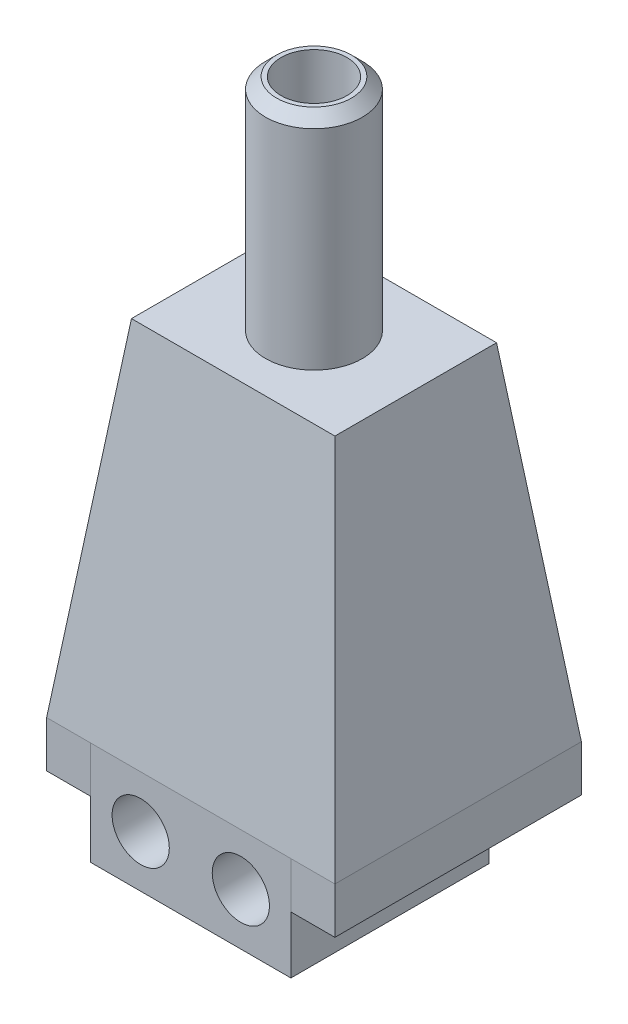
ISO-10303-21;
HEADER;
FILE_DESCRIPTION(('STEP AP214'),'2;1');
FILE_NAME('part.step','',(''),(''),'','','');
FILE_SCHEMA(('AUTOMOTIVE_DESIGN { 1 0 10303 214 1 1 1 1 }'));
ENDSEC;
DATA;
#1=APPLICATION_CONTEXT('core data for automotive mechanical design processes');
#2=APPLICATION_PROTOCOL_DEFINITION('international standard','automotive_design',2000,#1);
#3=PRODUCT_CONTEXT('',#1,'mechanical');
#4=PRODUCT('Part','Part','',(#3));
#5=PRODUCT_RELATED_PRODUCT_CATEGORY('part','',(#4));
#6=PRODUCT_DEFINITION_FORMATION('','',#4);
#7=PRODUCT_DEFINITION_CONTEXT('part definition',#1,'design');
#8=PRODUCT_DEFINITION('design','',#6,#7);
#9=PRODUCT_DEFINITION_SHAPE('','',#8);
#10=(LENGTH_UNIT() NAMED_UNIT(*) SI_UNIT(.MILLI.,.METRE.));
#11=(NAMED_UNIT(*) PLANE_ANGLE_UNIT() SI_UNIT($,.RADIAN.));
#12=(NAMED_UNIT(*) SI_UNIT($,.STERADIAN.) SOLID_ANGLE_UNIT());
#13=UNCERTAINTY_MEASURE_WITH_UNIT(LENGTH_MEASURE(1.E-05),#10,'distance_accuracy_value','');
#14=(GEOMETRIC_REPRESENTATION_CONTEXT(3) GLOBAL_UNCERTAINTY_ASSIGNED_CONTEXT((#13)) GLOBAL_UNIT_ASSIGNED_CONTEXT((#10,
#11,#12)) REPRESENTATION_CONTEXT('',''));
#15=CARTESIAN_POINT('',(0.,0.,0.));
#16=DIRECTION('',(0.,0.,1.));
#17=DIRECTION('',(1.,0.,0.));
#18=AXIS2_PLACEMENT_3D('',#15,#16,#17);
#19=CARTESIAN_POINT('',(0.,2.6,-4.5));
#20=DIRECTION('',(0.,0.,1.));
#21=DIRECTION('',(1.,0.,0.));
#22=AXIS2_PLACEMENT_3D('',#19,#20,#21);
#23=PLANE('',#22);
#24=DIRECTION('',(1.,0.,0.));
#25=VECTOR('',#24,1.);
#26=CARTESIAN_POINT('',(0.,4.7,-4.5));
#27=LINE('',#26,#25);
#28=CARTESIAN_POINT('',(-4.55,4.7,-4.5));
#29=VERTEX_POINT('',#28);
#30=CARTESIAN_POINT('',(4.55,4.7,-4.5));
#31=VERTEX_POINT('',#30);
#32=EDGE_CURVE('E186',#29,#31,#27,.T.);
#33=ORIENTED_EDGE('',*,*,#32,.F.);
#34=DIRECTION('',(0.,1.,0.));
#35=VECTOR('',#34,1.);
#36=CARTESIAN_POINT('',(-4.55,2.6,-4.5));
#37=LINE('',#36,#35);
#38=CARTESIAN_POINT('',(-4.55,2.6,-4.5));
#39=VERTEX_POINT('',#38);
#40=EDGE_CURVE('E12',#39,#29,#37,.T.);
#41=ORIENTED_EDGE('',*,*,#40,.F.);
#42=DIRECTION('',(1.,0.,0.));
#43=VECTOR('',#42,1.);
#44=CARTESIAN_POINT('',(0.,2.6,-4.5));
#45=LINE('',#44,#43);
#46=CARTESIAN_POINT('',(4.55,2.6,-4.5));
#47=VERTEX_POINT('',#46);
#48=EDGE_CURVE('E154',#39,#47,#45,.T.);
#49=ORIENTED_EDGE('',*,*,#48,.T.);
#50=DIRECTION('',(0.,1.,0.));
#51=VECTOR('',#50,1.);
#52=CARTESIAN_POINT('',(4.55,2.6,-4.5));
#53=LINE('',#52,#51);
#54=EDGE_CURVE('E70',#47,#31,#53,.T.);
#55=ORIENTED_EDGE('',*,*,#54,.T.);
#56=EDGE_LOOP('',(#33,#41,#49,#55));
#57=FACE_BOUND('',#56,.T.);
#58=ADVANCED_FACE('F54',(#57),#23,.T.);
#59=CARTESIAN_POINT('',(-4.55,2.6,0.));
#60=DIRECTION('',(1.,0.,0.));
#61=DIRECTION('',(0.,0.,-1.));
#62=AXIS2_PLACEMENT_3D('',#59,#60,#61);
#63=PLANE('',#62);
#64=DIRECTION('',(0.,0.,-1.));
#65=VECTOR('',#64,1.);
#66=CARTESIAN_POINT('',(-4.55,4.7,0.));
#67=LINE('',#66,#65);
#68=CARTESIAN_POINT('',(-4.55,4.7,4.5));
#69=VERTEX_POINT('',#68);
#70=EDGE_CURVE('E182',#69,#29,#67,.T.);
#71=ORIENTED_EDGE('',*,*,#70,.F.);
#72=DIRECTION('',(0.,1.,0.));
#73=VECTOR('',#72,1.);
#74=CARTESIAN_POINT('',(-4.55,2.6,4.5));
#75=LINE('',#74,#73);
#76=CARTESIAN_POINT('',(-4.55,2.6,4.5));
#77=VERTEX_POINT('',#76);
#78=EDGE_CURVE('E62',#77,#69,#75,.T.);
#79=ORIENTED_EDGE('',*,*,#78,.F.);
#80=DIRECTION('',(0.,0.,-1.));
#81=VECTOR('',#80,1.);
#82=CARTESIAN_POINT('',(-4.55,2.6,0.));
#83=LINE('',#82,#81);
#84=EDGE_CURVE('E149',#77,#39,#83,.T.);
#85=ORIENTED_EDGE('',*,*,#84,.T.);
#86=ORIENTED_EDGE('',*,*,#40,.T.);
#87=EDGE_LOOP('',(#71,#79,#85,#86));
#88=FACE_BOUND('',#87,.T.);
#89=ADVANCED_FACE('F185',(#88),#63,.T.);
#90=CARTESIAN_POINT('',(0.,2.6,4.5));
#91=DIRECTION('',(0.,0.,-1.));
#92=DIRECTION('',(-1.,0.,0.));
#93=AXIS2_PLACEMENT_3D('',#90,#91,#92);
#94=PLANE('',#93);
#95=DIRECTION('',(-1.,0.,0.));
#96=VECTOR('',#95,1.);
#97=CARTESIAN_POINT('',(0.,4.7,4.5));
#98=LINE('',#97,#96);
#99=CARTESIAN_POINT('',(-6.55,4.7,4.5));
#100=VERTEX_POINT('',#99);
#101=EDGE_CURVE('E163',#69,#100,#98,.T.);
#102=ORIENTED_EDGE('',*,*,#101,.T.);
#103=DIRECTION('',(0.,1.,0.));
#104=VECTOR('',#103,1.);
#105=CARTESIAN_POINT('',(-6.55,2.6,4.5));
#106=LINE('',#105,#104);
#107=CARTESIAN_POINT('',(-6.55,2.6,4.5));
#108=VERTEX_POINT('',#107);
#109=EDGE_CURVE('E173',#108,#100,#106,.T.);
#110=ORIENTED_EDGE('',*,*,#109,.F.);
#111=DIRECTION('',(-1.,0.,0.));
#112=VECTOR('',#111,1.);
#113=CARTESIAN_POINT('',(0.,2.6,4.5));
#114=LINE('',#113,#112);
#115=EDGE_CURVE('E144',#77,#108,#114,.T.);
#116=ORIENTED_EDGE('',*,*,#115,.F.);
#117=ORIENTED_EDGE('',*,*,#78,.T.);
#118=EDGE_LOOP('',(#102,#110,#116,#117));
#119=FACE_BOUND('',#118,.T.);
#120=ADVANCED_FACE('F177',(#119),#94,.F.);
#121=CARTESIAN_POINT('',(-6.55,2.6,0.));
#122=DIRECTION('',(1.,0.,0.));
#123=DIRECTION('',(0.,0.,-1.));
#124=AXIS2_PLACEMENT_3D('',#121,#122,#123);
#125=PLANE('',#124);
#126=DIRECTION('',(0.,0.,-1.));
#127=VECTOR('',#126,1.);
#128=CARTESIAN_POINT('',(-6.55,4.7,0.));
#129=LINE('',#128,#127);
#130=CARTESIAN_POINT('',(-6.55,4.7,-6.7));
#131=VERTEX_POINT('',#130);
#132=EDGE_CURVE('E184',#100,#131,#129,.T.);
#133=ORIENTED_EDGE('',*,*,#132,.T.);
#134=DIRECTION('',(0.,1.,0.));
#135=VECTOR('',#134,1.);
#136=CARTESIAN_POINT('',(-6.55,2.6,-6.7));
#137=LINE('',#136,#135);
#138=CARTESIAN_POINT('',(-6.55,2.6,-6.7));
#139=VERTEX_POINT('',#138);
#140=EDGE_CURVE('E170',#139,#131,#137,.T.);
#141=ORIENTED_EDGE('',*,*,#140,.F.);
#142=DIRECTION('',(0.,0.,-1.));
#143=VECTOR('',#142,1.);
#144=CARTESIAN_POINT('',(-6.55,2.6,0.));
#145=LINE('',#144,#143);
#146=EDGE_CURVE('E148',#108,#139,#145,.T.);
#147=ORIENTED_EDGE('',*,*,#146,.F.);
#148=ORIENTED_EDGE('',*,*,#109,.T.);
#149=EDGE_LOOP('',(#133,#141,#147,#148));
#150=FACE_BOUND('',#149,.T.);
#151=ADVANCED_FACE('F196',(#150),#125,.F.);
#152=CARTESIAN_POINT('',(0.,2.6,-6.7));
#153=DIRECTION('',(0.,0.,1.));
#154=DIRECTION('',(1.,0.,0.));
#155=AXIS2_PLACEMENT_3D('',#152,#153,#154);
#156=PLANE('',#155);
#157=DIRECTION('',(1.,0.,0.));
#158=VECTOR('',#157,1.);
#159=CARTESIAN_POINT('',(0.,4.7,-6.7));
#160=LINE('',#159,#158);
#161=CARTESIAN_POINT('',(6.55,4.7,-6.7));
#162=VERTEX_POINT('',#161);
#163=EDGE_CURVE('E190',#131,#162,#160,.T.);
#164=ORIENTED_EDGE('',*,*,#163,.T.);
#165=DIRECTION('',(0.,1.,0.));
#166=VECTOR('',#165,1.);
#167=CARTESIAN_POINT('',(6.55,2.6,-6.7));
#168=LINE('',#167,#166);
#169=CARTESIAN_POINT('',(6.55,2.6,-6.7));
#170=VERTEX_POINT('',#169);
#171=EDGE_CURVE('E139',#170,#162,#168,.T.);
#172=ORIENTED_EDGE('',*,*,#171,.F.);
#173=DIRECTION('',(1.,0.,0.));
#174=VECTOR('',#173,1.);
#175=CARTESIAN_POINT('',(0.,2.6,-6.7));
#176=LINE('',#175,#174);
#177=EDGE_CURVE('E127',#139,#170,#176,.T.);
#178=ORIENTED_EDGE('',*,*,#177,.F.);
#179=ORIENTED_EDGE('',*,*,#140,.T.);
#180=EDGE_LOOP('',(#164,#172,#178,#179));
#181=FACE_BOUND('',#180,.T.);
#182=ADVANCED_FACE('F192',(#181),#156,.F.);
#183=CARTESIAN_POINT('',(6.55,2.6,0.));
#184=DIRECTION('',(-1.,0.,0.));
#185=DIRECTION('',(0.,0.,1.));
#186=AXIS2_PLACEMENT_3D('',#183,#184,#185);
#187=PLANE('',#186);
#188=DIRECTION('',(0.,0.,1.));
#189=VECTOR('',#188,1.);
#190=CARTESIAN_POINT('',(6.55,4.7,0.));
#191=LINE('',#190,#189);
#192=CARTESIAN_POINT('',(6.55,4.7,4.5));
#193=VERTEX_POINT('',#192);
#194=EDGE_CURVE('E136',#162,#193,#191,.T.);
#195=ORIENTED_EDGE('',*,*,#194,.T.);
#196=DIRECTION('',(0.,1.,0.));
#197=VECTOR('',#196,1.);
#198=CARTESIAN_POINT('',(6.55,2.6,4.5));
#199=LINE('',#198,#197);
#200=CARTESIAN_POINT('',(6.55,2.6,4.5));
#201=VERTEX_POINT('',#200);
#202=EDGE_CURVE('E133',#201,#193,#199,.T.);
#203=ORIENTED_EDGE('',*,*,#202,.F.);
#204=DIRECTION('',(0.,0.,1.));
#205=VECTOR('',#204,1.);
#206=CARTESIAN_POINT('',(6.55,2.6,0.));
#207=LINE('',#206,#205);
#208=EDGE_CURVE('E120',#170,#201,#207,.T.);
#209=ORIENTED_EDGE('',*,*,#208,.F.);
#210=ORIENTED_EDGE('',*,*,#171,.T.);
#211=EDGE_LOOP('',(#195,#203,#209,#210));
#212=FACE_BOUND('',#211,.T.);
#213=ADVANCED_FACE('F134',(#212),#187,.F.);
#214=CARTESIAN_POINT('',(4.55,4.7,4.5));
#215=VERTEX_POINT('',#214);
#216=EDGE_CURVE('E159',#193,#215,#98,.T.);
#217=ORIENTED_EDGE('',*,*,#216,.T.);
#218=DIRECTION('',(0.,1.,0.));
#219=VECTOR('',#218,1.);
#220=CARTESIAN_POINT('',(4.55,2.6,4.5));
#221=LINE('',#220,#219);
#222=CARTESIAN_POINT('',(4.55,2.6,4.5));
#223=VERTEX_POINT('',#222);
#224=EDGE_CURVE('E96',#223,#215,#221,.T.);
#225=ORIENTED_EDGE('',*,*,#224,.F.);
#226=EDGE_CURVE('E125',#201,#223,#114,.T.);
#227=ORIENTED_EDGE('',*,*,#226,.F.);
#228=ORIENTED_EDGE('',*,*,#202,.T.);
#229=EDGE_LOOP('',(#217,#225,#227,#228));
#230=FACE_BOUND('',#229,.T.);
#231=ADVANCED_FACE('F141',(#230),#94,.F.);
#232=CARTESIAN_POINT('',(4.55,2.6,0.));
#233=DIRECTION('',(-1.,0.,0.));
#234=DIRECTION('',(0.,0.,1.));
#235=AXIS2_PLACEMENT_3D('',#232,#233,#234);
#236=PLANE('',#235);
#237=DIRECTION('',(0.,0.,1.));
#238=VECTOR('',#237,1.);
#239=CARTESIAN_POINT('',(4.55,4.7,0.));
#240=LINE('',#239,#238);
#241=EDGE_CURVE('E156',#31,#215,#240,.T.);
#242=ORIENTED_EDGE('',*,*,#241,.F.);
#243=ORIENTED_EDGE('',*,*,#54,.F.);
#244=DIRECTION('',(0.,0.,1.));
#245=VECTOR('',#244,1.);
#246=CARTESIAN_POINT('',(4.55,2.6,0.));
#247=LINE('',#246,#245);
#248=EDGE_CURVE('E142',#47,#223,#247,.T.);
#249=ORIENTED_EDGE('',*,*,#248,.T.);
#250=ORIENTED_EDGE('',*,*,#224,.T.);
#251=EDGE_LOOP('',(#242,#243,#249,#250));
#252=FACE_BOUND('',#251,.T.);
#253=ADVANCED_FACE('F209',(#252),#236,.T.);
#254=CARTESIAN_POINT('',(0.,2.6,0.));
#255=DIRECTION('',(0.,-1.,0.));
#256=DIRECTION('',(0.,0.,-1.));
#257=AXIS2_PLACEMENT_3D('',#254,#255,#256);
#258=PLANE('',#257);
#259=ORIENTED_EDGE('',*,*,#48,.F.);
#260=ORIENTED_EDGE('',*,*,#84,.F.);
#261=ORIENTED_EDGE('',*,*,#115,.T.);
#262=ORIENTED_EDGE('',*,*,#146,.T.);
#263=ORIENTED_EDGE('',*,*,#177,.T.);
#264=ORIENTED_EDGE('',*,*,#208,.T.);
#265=ORIENTED_EDGE('',*,*,#226,.T.);
#266=ORIENTED_EDGE('',*,*,#248,.F.);
#267=EDGE_LOOP('',(#259,#260,#261,#262,#263,#264,#265,#266));
#268=FACE_BOUND('',#267,.T.);
#269=ADVANCED_FACE('F122',(#268),#258,.T.);
#270=CARTESIAN_POINT('',(0.,4.7,0.));
#271=DIRECTION('',(0.,-1.,0.));
#272=DIRECTION('',(0.,0.,-1.));
#273=AXIS2_PLACEMENT_3D('',#270,#271,#272);
#274=PLANE('',#273);
#275=ORIENTED_EDGE('',*,*,#32,.T.);
#276=ORIENTED_EDGE('',*,*,#241,.T.);
#277=ORIENTED_EDGE('',*,*,#216,.F.);
#278=ORIENTED_EDGE('',*,*,#194,.F.);
#279=ORIENTED_EDGE('',*,*,#163,.F.);
#280=ORIENTED_EDGE('',*,*,#132,.F.);
#281=ORIENTED_EDGE('',*,*,#101,.F.);
#282=ORIENTED_EDGE('',*,*,#70,.T.);
#283=EDGE_LOOP('',(#275,#276,#277,#278,#279,#280,#281,#282));
#284=FACE_BOUND('',#283,.T.);
#285=ADVANCED_FACE('F181',(#284),#274,.F.);
#286=CLOSED_SHELL('',(#58,#89,#120,#151,#182,#213,#231,#253,#269,#285));
#287=MANIFOLD_SOLID_BREP('B2',#286);
#288=CARTESIAN_POINT('',(-6.55,4.7,4.5));
#289=DIRECTION('',(-0.992546151641322,0.121869343405148,0.));
#290=DIRECTION('',(-0.121869343405148,-0.992546151641322,0.));
#291=AXIS2_PLACEMENT_3D('',#288,#289,#290);
#292=PLANE('',#291);
#293=DIRECTION('',(0.,0.,1.));
#294=VECTOR('',#293,1.);
#295=CARTESIAN_POINT('',(-6.55,4.7,4.5));
#296=LINE('',#295,#294);
#297=CARTESIAN_POINT('',(-6.55,4.7,-6.7));
#298=VERTEX_POINT('',#297);
#299=CARTESIAN_POINT('',(-6.55,4.7,4.5));
#300=VERTEX_POINT('',#299);
#301=EDGE_CURVE('E427',#298,#300,#296,.T.);
#302=ORIENTED_EDGE('',*,*,#301,.T.);
#303=DIRECTION('',(-0.120974291151355,-0.985256536015293,0.120974291151355));
#304=VECTOR('',#303,1.);
#305=CARTESIAN_POINT('',(-6.55,4.7,4.5));
#306=LINE('',#305,#304);
#307=CARTESIAN_POINT('',(-4.62228239382439,20.4,2.57228239382439));
#308=VERTEX_POINT('',#307);
#309=EDGE_CURVE('E434',#308,#300,#306,.T.);
#310=ORIENTED_EDGE('',*,*,#309,.F.);
#311=DIRECTION('',(0.,0.,-1.));
#312=VECTOR('',#311,1.);
#313=CARTESIAN_POINT('',(-4.62228239382439,20.4,0.));
#314=LINE('',#313,#312);
#315=CARTESIAN_POINT('',(-4.62228239382439,20.4,-4.77228239382439));
#316=VERTEX_POINT('',#315);
#317=EDGE_CURVE('E443',#316,#308,#314,.F.);
#318=ORIENTED_EDGE('',*,*,#317,.F.);
#319=DIRECTION('',(-0.120974291151355,-0.985256536015293,-0.120974291151355));
#320=VECTOR('',#319,1.);
#321=CARTESIAN_POINT('',(-6.38609047386079,6.03493596372292,-6.53609047386078));
#322=LINE('',#321,#320);
#323=EDGE_CURVE('E447',#316,#298,#322,.T.);
#324=ORIENTED_EDGE('',*,*,#323,.T.);
#325=EDGE_LOOP('',(#302,#310,#318,#324));
#326=FACE_BOUND('',#325,.T.);
#327=ADVANCED_FACE('F323',(#326),#292,.T.);
#328=CARTESIAN_POINT('',(-6.55,4.7,4.5));
#329=DIRECTION('',(0.,0.121869343405148,0.992546151641322));
#330=DIRECTION('',(0.,-0.992546151641322,0.121869343405148));
#331=AXIS2_PLACEMENT_3D('',#328,#329,#330);
#332=PLANE('',#331);
#333=DIRECTION('',(1.,0.,0.));
#334=VECTOR('',#333,1.);
#335=CARTESIAN_POINT('',(-6.55,4.7,4.5));
#336=LINE('',#335,#334);
#337=CARTESIAN_POINT('',(6.55,4.7,4.5));
#338=VERTEX_POINT('',#337);
#339=EDGE_CURVE('E437',#300,#338,#336,.T.);
#340=ORIENTED_EDGE('',*,*,#339,.T.);
#341=DIRECTION('',(0.120974291151355,-0.985256536015293,0.120974291151355));
#342=VECTOR('',#341,1.);
#343=CARTESIAN_POINT('',(6.55,4.7,4.5));
#344=LINE('',#343,#342);
#345=CARTESIAN_POINT('',(4.6222823938244,20.4,2.57228239382439));
#346=VERTEX_POINT('',#345);
#347=EDGE_CURVE('E446',#346,#338,#344,.T.);
#348=ORIENTED_EDGE('',*,*,#347,.F.);
#349=DIRECTION('',(-1.,0.,0.));
#350=VECTOR('',#349,1.);
#351=CARTESIAN_POINT('',(0.,20.4,2.57228239382439));
#352=LINE('',#351,#350);
#353=EDGE_CURVE('E456',#308,#346,#352,.F.);
#354=ORIENTED_EDGE('',*,*,#353,.F.);
#355=ORIENTED_EDGE('',*,*,#309,.T.);
#356=EDGE_LOOP('',(#340,#348,#354,#355));
#357=FACE_BOUND('',#356,.T.);
#358=ADVANCED_FACE('F475',(#357),#332,.T.);
#359=CARTESIAN_POINT('',(6.55,4.7,4.5));
#360=DIRECTION('',(0.992546151641322,0.121869343405148,0.));
#361=DIRECTION('',(-0.121869343405148,0.992546151641322,0.));
#362=AXIS2_PLACEMENT_3D('',#359,#360,#361);
#363=PLANE('',#362);
#364=DIRECTION('',(0.,0.,-1.));
#365=VECTOR('',#364,1.);
#366=CARTESIAN_POINT('',(6.55,4.7,4.5));
#367=LINE('',#366,#365);
#368=CARTESIAN_POINT('',(6.55,4.7,-6.7));
#369=VERTEX_POINT('',#368);
#370=EDGE_CURVE('E439',#338,#369,#367,.T.);
#371=ORIENTED_EDGE('',*,*,#370,.T.);
#372=DIRECTION('',(0.120974291151355,-0.985256536015293,-0.120974291151355));
#373=VECTOR('',#372,1.);
#374=CARTESIAN_POINT('',(6.3582843935336,6.26139831471163,-6.5082843935336));
#375=LINE('',#374,#373);
#376=CARTESIAN_POINT('',(4.62228239382439,20.4,-4.7722823938244));
#377=VERTEX_POINT('',#376);
#378=EDGE_CURVE('E450',#377,#369,#375,.T.);
#379=ORIENTED_EDGE('',*,*,#378,.F.);
#380=DIRECTION('',(0.,0.,1.));
#381=VECTOR('',#380,1.);
#382=CARTESIAN_POINT('',(4.6222823938244,20.4,0.));
#383=LINE('',#382,#381);
#384=EDGE_CURVE('E344',#346,#377,#383,.F.);
#385=ORIENTED_EDGE('',*,*,#384,.F.);
#386=ORIENTED_EDGE('',*,*,#347,.T.);
#387=EDGE_LOOP('',(#371,#379,#385,#386));
#388=FACE_BOUND('',#387,.T.);
#389=ADVANCED_FACE('F481',(#388),#363,.T.);
#390=CARTESIAN_POINT('',(-6.55,4.7,-6.7));
#391=DIRECTION('',(0.,0.121869343405148,-0.992546151641322));
#392=DIRECTION('',(0.,0.992546151641322,0.121869343405148));
#393=AXIS2_PLACEMENT_3D('',#390,#391,#392);
#394=PLANE('',#393);
#395=DIRECTION('',(-1.,0.,0.));
#396=VECTOR('',#395,1.);
#397=CARTESIAN_POINT('',(-6.55,4.7,-6.7));
#398=LINE('',#397,#396);
#399=EDGE_CURVE('E441',#369,#298,#398,.T.);
#400=ORIENTED_EDGE('',*,*,#399,.T.);
#401=ORIENTED_EDGE('',*,*,#323,.F.);
#402=DIRECTION('',(1.,0.,0.));
#403=VECTOR('',#402,1.);
#404=CARTESIAN_POINT('',(0.,20.4,-4.77228239382439));
#405=LINE('',#404,#403);
#406=EDGE_CURVE('E339',#377,#316,#405,.F.);
#407=ORIENTED_EDGE('',*,*,#406,.F.);
#408=ORIENTED_EDGE('',*,*,#378,.T.);
#409=EDGE_LOOP('',(#400,#401,#407,#408));
#410=FACE_BOUND('',#409,.T.);
#411=ADVANCED_FACE('F487',(#410),#394,.T.);
#412=CARTESIAN_POINT('',(0.,20.4,0.));
#413=DIRECTION('',(0.,-1.,0.));
#414=DIRECTION('',(0.,0.,-1.));
#415=AXIS2_PLACEMENT_3D('',#412,#413,#414);
#416=PLANE('',#415);
#417=CARTESIAN_POINT('',(0.,20.4,-1.1));
#418=DIRECTION('',(0.,1.,0.));
#419=DIRECTION('',(0.,0.,1.));
#420=AXIS2_PLACEMENT_3D('',#417,#418,#419);
#421=CIRCLE('',#420,2.2);
#422=CARTESIAN_POINT('',(0.,20.4,1.1));
#423=VERTEX_POINT('',#422);
#424=EDGE_CURVE('E431',#423,#423,#421,.T.);
#425=ORIENTED_EDGE('',*,*,#424,.F.);
#426=EDGE_LOOP('',(#425));
#427=FACE_BOUND('',#426,.T.);
#428=ORIENTED_EDGE('',*,*,#317,.T.);
#429=ORIENTED_EDGE('',*,*,#353,.T.);
#430=ORIENTED_EDGE('',*,*,#384,.T.);
#431=ORIENTED_EDGE('',*,*,#406,.T.);
#432=EDGE_LOOP('',(#428,#429,#430,#431));
#433=FACE_BOUND('',#432,.T.);
#434=ADVANCED_FACE('F490',(#427,#433),#416,.F.);
#435=CARTESIAN_POINT('',(0.,4.7,0.));
#436=DIRECTION('',(0.,-1.,0.));
#437=DIRECTION('',(0.,0.,-1.));
#438=AXIS2_PLACEMENT_3D('',#435,#436,#437);
#439=PLANE('',#438);
#440=ORIENTED_EDGE('',*,*,#301,.F.);
#441=ORIENTED_EDGE('',*,*,#399,.F.);
#442=ORIENTED_EDGE('',*,*,#370,.F.);
#443=ORIENTED_EDGE('',*,*,#339,.F.);
#444=EDGE_LOOP('',(#440,#441,#442,#443));
#445=FACE_BOUND('',#444,.T.);
#446=ADVANCED_FACE('F485',(#445),#439,.T.);
#447=CARTESIAN_POINT('',(0.,30.4,-1.1));
#448=DIRECTION('',(0.,-1.,0.));
#449=DIRECTION('',(0.,0.,-1.));
#450=AXIS2_PLACEMENT_3D('',#447,#448,#449);
#451=CYLINDRICAL_SURFACE('',#450,2.2);
#452=CARTESIAN_POINT('',(0.,29.9,-1.1));
#453=DIRECTION('',(0.,1.,0.));
#454=DIRECTION('',(0.,0.,1.));
#455=AXIS2_PLACEMENT_3D('',#452,#453,#454);
#456=CIRCLE('',#455,2.2);
#457=CARTESIAN_POINT('',(0.,29.9,1.1));
#458=VERTEX_POINT('',#457);
#459=EDGE_CURVE('E52',#458,#458,#456,.F.);
#460=ORIENTED_EDGE('',*,*,#459,.T.);
#461=EDGE_LOOP('',(#460));
#462=FACE_BOUND('',#461,.T.);
#463=ORIENTED_EDGE('',*,*,#424,.T.);
#464=EDGE_LOOP('',(#463));
#465=FACE_BOUND('',#464,.T.);
#466=ADVANCED_FACE('F508',(#462,#465),#451,.T.);
#467=CARTESIAN_POINT('',(0.,30.4,-1.1));
#468=DIRECTION('',(0.,1.,0.));
#469=DIRECTION('',(0.,0.,1.));
#470=AXIS2_PLACEMENT_3D('',#467,#468,#469);
#471=PLANE('',#470);
#472=CARTESIAN_POINT('',(0.,30.4,-1.1));
#473=DIRECTION('',(0.,1.,0.));
#474=DIRECTION('',(0.,0.,1.));
#475=AXIS2_PLACEMENT_3D('',#472,#473,#474);
#476=CIRCLE('',#475,1.7);
#477=CARTESIAN_POINT('',(0.,30.4,0.599999999999996));
#478=VERTEX_POINT('',#477);
#479=EDGE_CURVE('E332',#478,#478,#476,.T.);
#480=ORIENTED_EDGE('',*,*,#479,.T.);
#481=EDGE_LOOP('',(#480));
#482=FACE_BOUND('',#481,.T.);
#483=CARTESIAN_POINT('',(0.,30.4,-1.1));
#484=DIRECTION('',(0.,1.,0.));
#485=DIRECTION('',(0.,0.,1.));
#486=AXIS2_PLACEMENT_3D('',#483,#484,#485);
#487=CIRCLE('',#486,1.5);
#488=CARTESIAN_POINT('',(0.,30.4,0.399999999999999));
#489=VERTEX_POINT('',#488);
#490=EDGE_CURVE('E428',#489,#489,#487,.T.);
#491=ORIENTED_EDGE('',*,*,#490,.F.);
#492=EDGE_LOOP('',(#491));
#493=FACE_BOUND('',#492,.T.);
#494=ADVANCED_FACE('F462',(#482,#493),#471,.T.);
#495=CARTESIAN_POINT('',(-5.85521769385107,4.6146914596164,4.5));
#496=DIRECTION('',(-0.992546151641322,0.121869343405148,0.));
#497=DIRECTION('',(-0.121869343405148,-0.992546151641322,0.));
#498=AXIS2_PLACEMENT_3D('',#495,#496,#497);
#499=PLANE('',#498);
#500=DIRECTION('',(0.,0.,-1.));
#501=VECTOR('',#500,1.);
#502=CARTESIAN_POINT('',(-5.75879392954677,5.4,0.));
#503=LINE('',#502,#501);
#504=CARTESIAN_POINT('',(-5.75879392954677,5.4,-5.90879392954677));
#505=VERTEX_POINT('',#504);
#506=CARTESIAN_POINT('',(-5.75879392954677,5.4,3.70879392954677));
#507=VERTEX_POINT('',#506);
#508=EDGE_CURVE('E395',#505,#507,#503,.F.);
#509=ORIENTED_EDGE('',*,*,#508,.F.);
#510=DIRECTION('',(-0.120974291151355,-0.985256536015293,-0.120974291151355));
#511=VECTOR('',#510,1.);
#512=CARTESIAN_POINT('',(-5.70147615329854,5.86681582624677,-5.85147615329854));
#513=LINE('',#512,#511);
#514=CARTESIAN_POINT('',(-4.00297470863523,19.7,-4.15297470863523));
#515=VERTEX_POINT('',#514);
#516=EDGE_CURVE('E419',#515,#505,#513,.T.);
#517=ORIENTED_EDGE('',*,*,#516,.F.);
#518=DIRECTION('',(0.,0.,-1.));
#519=VECTOR('',#518,1.);
#520=CARTESIAN_POINT('',(-4.00297470863523,19.7,0.));
#521=LINE('',#520,#519);
#522=CARTESIAN_POINT('',(-4.00297470863523,19.7,1.95297470863523));
#523=VERTEX_POINT('',#522);
#524=EDGE_CURVE('E414',#515,#523,#521,.F.);
#525=ORIENTED_EDGE('',*,*,#524,.T.);
#526=DIRECTION('',(-0.120974291151355,-0.985256536015293,0.120974291151355));
#527=VECTOR('',#526,1.);
#528=CARTESIAN_POINT('',(-5.86538567943775,4.53187986252385,3.81538567943775));
#529=LINE('',#528,#527);
#530=EDGE_CURVE('E406',#523,#507,#529,.T.);
#531=ORIENTED_EDGE('',*,*,#530,.T.);
#532=EDGE_LOOP('',(#509,#517,#525,#531));
#533=FACE_BOUND('',#532,.T.);
#534=ADVANCED_FACE('F515',(#533),#499,.F.);
#535=CARTESIAN_POINT('',(-6.55,4.6146914596164,3.80521769385107));
#536=DIRECTION('',(0.,0.121869343405148,0.992546151641322));
#537=DIRECTION('',(0.,-0.992546151641322,0.121869343405148));
#538=AXIS2_PLACEMENT_3D('',#535,#536,#537);
#539=PLANE('',#538);
#540=DIRECTION('',(-1.,0.,0.));
#541=VECTOR('',#540,1.);
#542=CARTESIAN_POINT('',(0.,5.4,3.70879392954677));
#543=LINE('',#542,#541);
#544=CARTESIAN_POINT('',(5.75879392954677,5.4,3.70879392954677));
#545=VERTEX_POINT('',#544);
#546=EDGE_CURVE('E388',#507,#545,#543,.F.);
#547=ORIENTED_EDGE('',*,*,#546,.F.);
#548=ORIENTED_EDGE('',*,*,#530,.F.);
#549=DIRECTION('',(-1.,0.,0.));
#550=VECTOR('',#549,1.);
#551=CARTESIAN_POINT('',(0.,19.7,1.95297470863523));
#552=LINE('',#551,#550);
#553=CARTESIAN_POINT('',(4.00297470863523,19.7,1.95297470863523));
#554=VERTEX_POINT('',#553);
#555=EDGE_CURVE('E403',#523,#554,#552,.F.);
#556=ORIENTED_EDGE('',*,*,#555,.T.);
#557=DIRECTION('',(0.120974291151355,-0.985256536015293,0.120974291151355));
#558=VECTOR('',#557,1.);
#559=CARTESIAN_POINT('',(5.86538567943775,4.53187986252385,3.81538567943775));
#560=LINE('',#559,#558);
#561=EDGE_CURVE('E401',#554,#545,#560,.T.);
#562=ORIENTED_EDGE('',*,*,#561,.T.);
#563=EDGE_LOOP('',(#547,#548,#556,#562));
#564=FACE_BOUND('',#563,.T.);
#565=ADVANCED_FACE('F402',(#564),#539,.F.);
#566=CARTESIAN_POINT('',(5.85521769385108,4.6146914596164,4.5));
#567=DIRECTION('',(0.992546151641322,0.121869343405148,0.));
#568=DIRECTION('',(-0.121869343405148,0.992546151641322,0.));
#569=AXIS2_PLACEMENT_3D('',#566,#567,#568);
#570=PLANE('',#569);
#571=DIRECTION('',(0.,0.,1.));
#572=VECTOR('',#571,1.);
#573=CARTESIAN_POINT('',(5.75879392954677,5.4,0.));
#574=LINE('',#573,#572);
#575=CARTESIAN_POINT('',(5.75879392954677,5.4,-5.90879392954677));
#576=VERTEX_POINT('',#575);
#577=EDGE_CURVE('E392',#545,#576,#574,.F.);
#578=ORIENTED_EDGE('',*,*,#577,.F.);
#579=ORIENTED_EDGE('',*,*,#561,.F.);
#580=DIRECTION('',(0.,0.,1.));
#581=VECTOR('',#580,1.);
#582=CARTESIAN_POINT('',(4.00297470863523,19.7,0.));
#583=LINE('',#582,#581);
#584=CARTESIAN_POINT('',(4.00297470863523,19.7,-4.15297470863524));
#585=VERTEX_POINT('',#584);
#586=EDGE_CURVE('E420',#554,#585,#583,.F.);
#587=ORIENTED_EDGE('',*,*,#586,.T.);
#588=DIRECTION('',(0.120974291151355,-0.985256536015293,-0.120974291151355));
#589=VECTOR('',#588,1.);
#590=CARTESIAN_POINT('',(5.67367007297135,6.09327817723548,-5.82367007297135));
#591=LINE('',#590,#589);
#592=EDGE_CURVE('E407',#585,#576,#591,.T.);
#593=ORIENTED_EDGE('',*,*,#592,.T.);
#594=EDGE_LOOP('',(#578,#579,#587,#593));
#595=FACE_BOUND('',#594,.T.);
#596=ADVANCED_FACE('F409',(#595),#570,.F.);
#597=CARTESIAN_POINT('',(-6.55,4.6146914596164,-6.00521769385108));
#598=DIRECTION('',(0.,0.121869343405148,-0.992546151641322));
#599=DIRECTION('',(0.,0.992546151641322,0.121869343405148));
#600=AXIS2_PLACEMENT_3D('',#597,#598,#599);
#601=PLANE('',#600);
#602=DIRECTION('',(1.,0.,0.));
#603=VECTOR('',#602,1.);
#604=CARTESIAN_POINT('',(0.,5.4,-5.90879392954677));
#605=LINE('',#604,#603);
#606=EDGE_CURVE('E412',#576,#505,#605,.F.);
#607=ORIENTED_EDGE('',*,*,#606,.F.);
#608=ORIENTED_EDGE('',*,*,#592,.F.);
#609=DIRECTION('',(1.,0.,0.));
#610=VECTOR('',#609,1.);
#611=CARTESIAN_POINT('',(0.,19.7,-4.15297470863523));
#612=LINE('',#611,#610);
#613=EDGE_CURVE('E421',#585,#515,#612,.F.);
#614=ORIENTED_EDGE('',*,*,#613,.T.);
#615=ORIENTED_EDGE('',*,*,#516,.T.);
#616=EDGE_LOOP('',(#607,#608,#614,#615));
#617=FACE_BOUND('',#616,.T.);
#618=ADVANCED_FACE('F522',(#617),#601,.F.);
#619=CARTESIAN_POINT('',(0.,19.7,0.));
#620=DIRECTION('',(0.,-1.,0.));
#621=DIRECTION('',(0.,0.,-1.));
#622=AXIS2_PLACEMENT_3D('',#619,#620,#621);
#623=PLANE('',#622);
#624=CARTESIAN_POINT('',(0.,19.7,-1.1));
#625=DIRECTION('',(0.,-1.,0.));
#626=DIRECTION('',(0.,0.,-1.));
#627=AXIS2_PLACEMENT_3D('',#624,#625,#626);
#628=CIRCLE('',#627,1.5);
#629=CARTESIAN_POINT('',(0.,19.7,-2.6));
#630=VERTEX_POINT('',#629);
#631=EDGE_CURVE('E424',#630,#630,#628,.F.);
#632=ORIENTED_EDGE('',*,*,#631,.T.);
#633=EDGE_LOOP('',(#632));
#634=FACE_BOUND('',#633,.T.);
#635=ORIENTED_EDGE('',*,*,#524,.F.);
#636=ORIENTED_EDGE('',*,*,#613,.F.);
#637=ORIENTED_EDGE('',*,*,#586,.F.);
#638=ORIENTED_EDGE('',*,*,#555,.F.);
#639=EDGE_LOOP('',(#635,#636,#637,#638));
#640=FACE_BOUND('',#639,.T.);
#641=ADVANCED_FACE('F519',(#634,#640),#623,.T.);
#642=CARTESIAN_POINT('',(0.,5.4,0.));
#643=DIRECTION('',(0.,-1.,0.));
#644=DIRECTION('',(0.,0.,-1.));
#645=AXIS2_PLACEMENT_3D('',#642,#643,#644);
#646=PLANE('',#645);
#647=ORIENTED_EDGE('',*,*,#508,.T.);
#648=ORIENTED_EDGE('',*,*,#546,.T.);
#649=ORIENTED_EDGE('',*,*,#577,.T.);
#650=ORIENTED_EDGE('',*,*,#606,.T.);
#651=EDGE_LOOP('',(#647,#648,#649,#650));
#652=FACE_BOUND('',#651,.T.);
#653=ADVANCED_FACE('F390',(#652),#646,.F.);
#654=CARTESIAN_POINT('',(0.,30.4,-1.1));
#655=DIRECTION('',(0.,-1.,0.));
#656=DIRECTION('',(0.,0.,-1.));
#657=AXIS2_PLACEMENT_3D('',#654,#655,#656);
#658=CYLINDRICAL_SURFACE('',#657,1.5);
#659=ORIENTED_EDGE('',*,*,#490,.T.);
#660=EDGE_LOOP('',(#659));
#661=FACE_BOUND('',#660,.T.);
#662=ORIENTED_EDGE('',*,*,#631,.F.);
#663=EDGE_LOOP('',(#662));
#664=FACE_BOUND('',#663,.T.);
#665=ADVANCED_FACE('F466',(#661,#664),#658,.F.);
#666=CARTESIAN_POINT('',(0.,30.4,-1.1));
#667=DIRECTION('',(0.,-1.,0.));
#668=DIRECTION('',(0.,0.,-1.));
#669=AXIS2_PLACEMENT_3D('',#666,#667,#668);
#670=CONICAL_SURFACE('',#669,1.7,0.785398163397451);
#671=ORIENTED_EDGE('',*,*,#459,.F.);
#672=EDGE_LOOP('',(#671));
#673=FACE_BOUND('',#672,.T.);
#674=ORIENTED_EDGE('',*,*,#479,.F.);
#675=EDGE_LOOP('',(#674));
#676=FACE_BOUND('',#675,.T.);
#677=ADVANCED_FACE('F326',(#673,#676),#670,.T.);
#678=CLOSED_SHELL('',(#327,#358,#389,#411,#434,#446,#466,#494,#534,#565,#596,#618,#641,#653,
#665,#677));
#679=MANIFOLD_SOLID_BREP('B6',#678);
#680=CARTESIAN_POINT('',(4.55,4.7,4.5));
#681=DIRECTION('',(-1.,0.,0.));
#682=DIRECTION('',(0.,0.,1.));
#683=AXIS2_PLACEMENT_3D('',#680,#681,#682);
#684=PLANE('',#683);
#685=DIRECTION('',(0.,0.,-1.));
#686=VECTOR('',#685,1.);
#687=CARTESIAN_POINT('',(4.55,0.,4.5));
#688=LINE('',#687,#686);
#689=CARTESIAN_POINT('',(4.55,0.,4.5));
#690=VERTEX_POINT('',#689);
#691=CARTESIAN_POINT('',(4.55,0.,-4.5));
#692=VERTEX_POINT('',#691);
#693=EDGE_CURVE('E735',#690,#692,#688,.T.);
#694=ORIENTED_EDGE('',*,*,#693,.T.);
#695=DIRECTION('',(0.,-1.,0.));
#696=VECTOR('',#695,1.);
#697=CARTESIAN_POINT('',(4.55,4.7,-4.5));
#698=LINE('',#697,#696);
#699=CARTESIAN_POINT('',(4.55,4.7,-4.5));
#700=VERTEX_POINT('',#699);
#701=EDGE_CURVE('E321',#700,#692,#698,.T.);
#702=ORIENTED_EDGE('',*,*,#701,.F.);
#703=DIRECTION('',(0.,0.,-1.));
#704=VECTOR('',#703,1.);
#705=CARTESIAN_POINT('',(4.55,4.7,4.5));
#706=LINE('',#705,#704);
#707=CARTESIAN_POINT('',(4.55,4.7,4.5));
#708=VERTEX_POINT('',#707);
#709=EDGE_CURVE('E723',#708,#700,#706,.T.);
#710=ORIENTED_EDGE('',*,*,#709,.F.);
#711=DIRECTION('',(0.,-1.,0.));
#712=VECTOR('',#711,1.);
#713=CARTESIAN_POINT('',(4.55,4.7,4.5));
#714=LINE('',#713,#712);
#715=EDGE_CURVE('E731',#708,#690,#714,.T.);
#716=ORIENTED_EDGE('',*,*,#715,.T.);
#717=EDGE_LOOP('',(#694,#702,#710,#716));
#718=FACE_BOUND('',#717,.T.);
#719=ADVANCED_FACE('F672',(#718),#684,.F.);
#720=CARTESIAN_POINT('',(-4.55,4.7,-4.5));
#721=DIRECTION('',(0.,0.,1.));
#722=DIRECTION('',(1.,0.,0.));
#723=AXIS2_PLACEMENT_3D('',#720,#721,#722);
#724=PLANE('',#723);
#725=DIRECTION('',(-1.,0.,0.));
#726=VECTOR('',#725,1.);
#727=CARTESIAN_POINT('',(-4.55,0.,-4.5));
#728=LINE('',#727,#726);
#729=CARTESIAN_POINT('',(-4.55,0.,-4.5));
#730=VERTEX_POINT('',#729);
#731=EDGE_CURVE('E727',#692,#730,#728,.T.);
#732=ORIENTED_EDGE('',*,*,#731,.T.);
#733=DIRECTION('',(0.,-1.,0.));
#734=VECTOR('',#733,1.);
#735=CARTESIAN_POINT('',(-4.55,4.7,-4.5));
#736=LINE('',#735,#734);
#737=CARTESIAN_POINT('',(-4.55,4.7,-4.5));
#738=VERTEX_POINT('',#737);
#739=EDGE_CURVE('E680',#738,#730,#736,.T.);
#740=ORIENTED_EDGE('',*,*,#739,.F.);
#741=DIRECTION('',(-1.,0.,0.));
#742=VECTOR('',#741,1.);
#743=CARTESIAN_POINT('',(-4.55,4.7,-4.5));
#744=LINE('',#743,#742);
#745=EDGE_CURVE('E718',#700,#738,#744,.T.);
#746=ORIENTED_EDGE('',*,*,#745,.F.);
#747=ORIENTED_EDGE('',*,*,#701,.T.);
#748=EDGE_LOOP('',(#732,#740,#746,#747));
#749=FACE_BOUND('',#748,.T.);
#750=ADVANCED_FACE('F726',(#749),#724,.F.);
#751=CARTESIAN_POINT('',(-4.55,4.7,4.5));
#752=DIRECTION('',(1.,0.,0.));
#753=DIRECTION('',(0.,0.,-1.));
#754=AXIS2_PLACEMENT_3D('',#751,#752,#753);
#755=PLANE('',#754);
#756=DIRECTION('',(0.,0.,1.));
#757=VECTOR('',#756,1.);
#758=CARTESIAN_POINT('',(-4.55,0.,4.5));
#759=LINE('',#758,#757);
#760=CARTESIAN_POINT('',(-4.55,0.,4.5));
#761=VERTEX_POINT('',#760);
#762=EDGE_CURVE('E705',#730,#761,#759,.T.);
#763=ORIENTED_EDGE('',*,*,#762,.T.);
#764=DIRECTION('',(0.,-1.,0.));
#765=VECTOR('',#764,1.);
#766=CARTESIAN_POINT('',(-4.55,4.7,4.5));
#767=LINE('',#766,#765);
#768=CARTESIAN_POINT('',(-4.55,4.7,4.5));
#769=VERTEX_POINT('',#768);
#770=EDGE_CURVE('E728',#769,#761,#767,.T.);
#771=ORIENTED_EDGE('',*,*,#770,.F.);
#772=DIRECTION('',(0.,0.,1.));
#773=VECTOR('',#772,1.);
#774=CARTESIAN_POINT('',(-4.55,4.7,4.5));
#775=LINE('',#774,#773);
#776=EDGE_CURVE('E721',#738,#769,#775,.T.);
#777=ORIENTED_EDGE('',*,*,#776,.F.);
#778=ORIENTED_EDGE('',*,*,#739,.T.);
#779=EDGE_LOOP('',(#763,#771,#777,#778));
#780=FACE_BOUND('',#779,.T.);
#781=ADVANCED_FACE('F729',(#780),#755,.F.);
#782=CARTESIAN_POINT('',(-4.55,4.7,4.5));
#783=DIRECTION('',(0.,0.,-1.));
#784=DIRECTION('',(-1.,0.,0.));
#785=AXIS2_PLACEMENT_3D('',#782,#783,#784);
#786=PLANE('',#785);
#787=CARTESIAN_POINT('',(-2.275,2.35,4.5));
#788=DIRECTION('',(0.,0.,1.));
#789=DIRECTION('',(1.,0.,0.));
#790=AXIS2_PLACEMENT_3D('',#787,#788,#789);
#791=CIRCLE('',#790,1.3);
#792=CARTESIAN_POINT('',(-0.975,2.35,4.5));
#793=VERTEX_POINT('',#792);
#794=EDGE_CURVE('E755',#793,#793,#791,.T.);
#795=ORIENTED_EDGE('',*,*,#794,.F.);
#796=EDGE_LOOP('',(#795));
#797=FACE_BOUND('',#796,.T.);
#798=CARTESIAN_POINT('',(2.275,2.35,4.5));
#799=DIRECTION('',(0.,0.,1.));
#800=DIRECTION('',(-1.,0.,0.));
#801=AXIS2_PLACEMENT_3D('',#798,#799,#800);
#802=CIRCLE('',#801,1.3);
#803=CARTESIAN_POINT('',(0.975,2.35,4.5));
#804=VERTEX_POINT('',#803);
#805=EDGE_CURVE('E752',#804,#804,#802,.T.);
#806=ORIENTED_EDGE('',*,*,#805,.F.);
#807=EDGE_LOOP('',(#806));
#808=FACE_BOUND('',#807,.T.);
#809=DIRECTION('',(1.,0.,0.));
#810=VECTOR('',#809,1.);
#811=CARTESIAN_POINT('',(-4.55,0.,4.5));
#812=LINE('',#811,#810);
#813=EDGE_CURVE('E711',#761,#690,#812,.T.);
#814=ORIENTED_EDGE('',*,*,#813,.T.);
#815=ORIENTED_EDGE('',*,*,#715,.F.);
#816=DIRECTION('',(1.,0.,0.));
#817=VECTOR('',#816,1.);
#818=CARTESIAN_POINT('',(-4.55,4.7,4.5));
#819=LINE('',#818,#817);
#820=EDGE_CURVE('E688',#769,#708,#819,.T.);
#821=ORIENTED_EDGE('',*,*,#820,.F.);
#822=ORIENTED_EDGE('',*,*,#770,.T.);
#823=EDGE_LOOP('',(#814,#815,#821,#822));
#824=FACE_BOUND('',#823,.T.);
#825=ADVANCED_FACE('F743',(#797,#808,#824),#786,.F.);
#826=CARTESIAN_POINT('',(0.,4.7,0.));
#827=DIRECTION('',(0.,-1.,0.));
#828=DIRECTION('',(0.,0.,-1.));
#829=AXIS2_PLACEMENT_3D('',#826,#827,#828);
#830=PLANE('',#829);
#831=ORIENTED_EDGE('',*,*,#709,.T.);
#832=ORIENTED_EDGE('',*,*,#745,.T.);
#833=ORIENTED_EDGE('',*,*,#776,.T.);
#834=ORIENTED_EDGE('',*,*,#820,.T.);
#835=EDGE_LOOP('',(#831,#832,#833,#834));
#836=FACE_BOUND('',#835,.T.);
#837=ADVANCED_FACE('F719',(#836),#830,.F.);
#838=CARTESIAN_POINT('',(0.,0.,0.));
#839=DIRECTION('',(0.,-1.,0.));
#840=DIRECTION('',(0.,0.,-1.));
#841=AXIS2_PLACEMENT_3D('',#838,#839,#840);
#842=PLANE('',#841);
#843=ORIENTED_EDGE('',*,*,#693,.F.);
#844=ORIENTED_EDGE('',*,*,#813,.F.);
#845=ORIENTED_EDGE('',*,*,#762,.F.);
#846=ORIENTED_EDGE('',*,*,#731,.F.);
#847=EDGE_LOOP('',(#843,#844,#845,#846));
#848=FACE_BOUND('',#847,.T.);
#849=ADVANCED_FACE('F746',(#848),#842,.T.);
#850=CARTESIAN_POINT('',(2.275,2.35,2.5));
#851=DIRECTION('',(0.,0.,1.));
#852=DIRECTION('',(1.,0.,0.));
#853=AXIS2_PLACEMENT_3D('',#850,#851,#852);
#854=CYLINDRICAL_SURFACE('',#853,1.3);
#855=CARTESIAN_POINT('',(2.275,2.35,2.5));
#856=DIRECTION('',(0.,0.,1.));
#857=DIRECTION('',(-1.,0.,0.));
#858=AXIS2_PLACEMENT_3D('',#855,#856,#857);
#859=CIRCLE('',#858,1.3);
#860=CARTESIAN_POINT('',(0.975,2.35,2.5));
#861=VERTEX_POINT('',#860);
#862=EDGE_CURVE('E749',#861,#861,#859,.T.);
#863=ORIENTED_EDGE('',*,*,#862,.F.);
#864=EDGE_LOOP('',(#863));
#865=FACE_BOUND('',#864,.T.);
#866=ORIENTED_EDGE('',*,*,#805,.T.);
#867=EDGE_LOOP('',(#866));
#868=FACE_BOUND('',#867,.T.);
#869=ADVANCED_FACE('F775',(#865,#868),#854,.F.);
#870=CARTESIAN_POINT('',(2.275,2.35,2.5));
#871=DIRECTION('',(0.,0.,-1.));
#872=DIRECTION('',(-1.,0.,0.));
#873=AXIS2_PLACEMENT_3D('',#870,#871,#872);
#874=PLANE('',#873);
#875=ORIENTED_EDGE('',*,*,#862,.T.);
#876=EDGE_LOOP('',(#875));
#877=FACE_BOUND('',#876,.T.);
#878=ADVANCED_FACE('F766',(#877),#874,.F.);
#879=CARTESIAN_POINT('',(-2.275,2.35,2.5));
#880=DIRECTION('',(0.,0.,1.));
#881=DIRECTION('',(1.,0.,0.));
#882=AXIS2_PLACEMENT_3D('',#879,#880,#881);
#883=CYLINDRICAL_SURFACE('',#882,1.3);
#884=CARTESIAN_POINT('',(-2.275,2.35,2.5));
#885=DIRECTION('',(0.,0.,1.));
#886=DIRECTION('',(1.,0.,0.));
#887=AXIS2_PLACEMENT_3D('',#884,#885,#886);
#888=CIRCLE('',#887,1.3);
#889=CARTESIAN_POINT('',(-0.975,2.35,2.5));
#890=VERTEX_POINT('',#889);
#891=EDGE_CURVE('E738',#890,#890,#888,.T.);
#892=ORIENTED_EDGE('',*,*,#891,.F.);
#893=EDGE_LOOP('',(#892));
#894=FACE_BOUND('',#893,.T.);
#895=ORIENTED_EDGE('',*,*,#794,.T.);
#896=EDGE_LOOP('',(#895));
#897=FACE_BOUND('',#896,.T.);
#898=ADVANCED_FACE('F763',(#894,#897),#883,.F.);
#899=CARTESIAN_POINT('',(-2.275,2.35,2.5));
#900=DIRECTION('',(0.,0.,1.));
#901=DIRECTION('',(1.,0.,0.));
#902=AXIS2_PLACEMENT_3D('',#899,#900,#901);
#903=PLANE('',#902);
#904=ORIENTED_EDGE('',*,*,#891,.T.);
#905=EDGE_LOOP('',(#904));
#906=FACE_BOUND('',#905,.T.);
#907=ADVANCED_FACE('F761',(#906),#903,.T.);
#908=CLOSED_SHELL('',(#719,#750,#781,#825,#837,#849,#869,#878,#898,#907));
#909=MANIFOLD_SOLID_BREP('B46',#908);
#910=ADVANCED_BREP_SHAPE_REPRESENTATION('',(#18,#287,#679,#909),#14);
#911=SHAPE_DEFINITION_REPRESENTATION(#9,#910);
ENDSEC;
END-ISO-10303-21;
